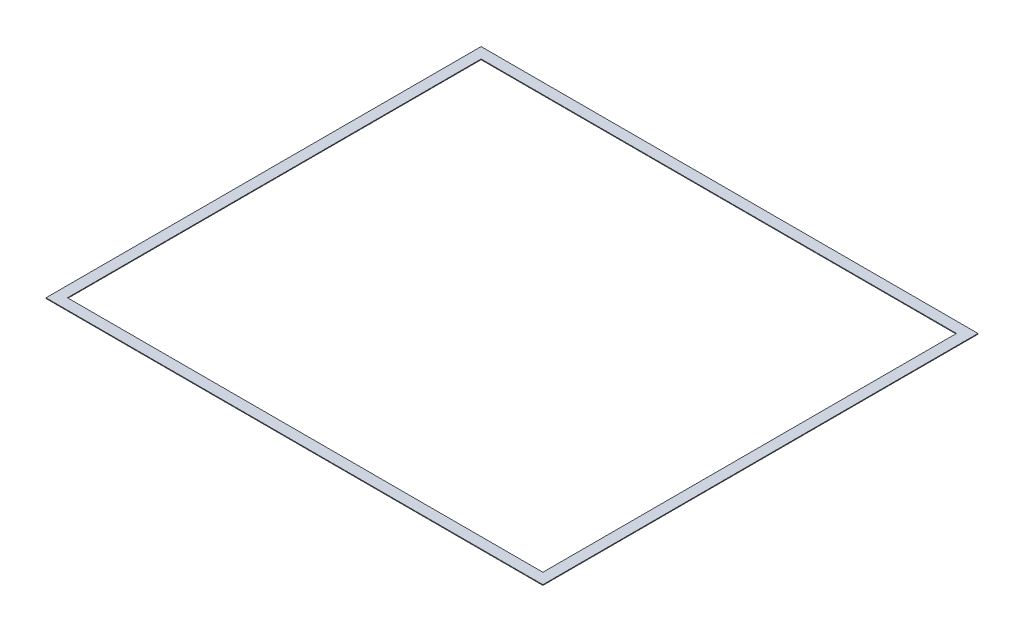
ISO-10303-21;
HEADER;
FILE_DESCRIPTION(('STEP AP214'),'2;1');
FILE_NAME('part.step','',(''),(''),'','','');
FILE_SCHEMA(('AUTOMOTIVE_DESIGN { 1 0 10303 214 1 1 1 1 }'));
ENDSEC;
DATA;
#1=APPLICATION_CONTEXT('core data for automotive mechanical design processes');
#2=APPLICATION_PROTOCOL_DEFINITION('international standard','automotive_design',2000,#1);
#3=PRODUCT_CONTEXT('',#1,'mechanical');
#4=PRODUCT('Part','Part','',(#3));
#5=PRODUCT_RELATED_PRODUCT_CATEGORY('part','',(#4));
#6=PRODUCT_DEFINITION_FORMATION('','',#4);
#7=PRODUCT_DEFINITION_CONTEXT('part definition',#1,'design');
#8=PRODUCT_DEFINITION('design','',#6,#7);
#9=PRODUCT_DEFINITION_SHAPE('','',#8);
#10=(LENGTH_UNIT() NAMED_UNIT(*) SI_UNIT(.MILLI.,.METRE.));
#11=(NAMED_UNIT(*) PLANE_ANGLE_UNIT() SI_UNIT($,.RADIAN.));
#12=(NAMED_UNIT(*) SI_UNIT($,.STERADIAN.) SOLID_ANGLE_UNIT());
#13=UNCERTAINTY_MEASURE_WITH_UNIT(LENGTH_MEASURE(1.E-05),#10,'distance_accuracy_value','');
#14=(GEOMETRIC_REPRESENTATION_CONTEXT(3) GLOBAL_UNCERTAINTY_ASSIGNED_CONTEXT((#13)) GLOBAL_UNIT_ASSIGNED_CONTEXT((#10,
#11,#12)) REPRESENTATION_CONTEXT('',''));
#15=CARTESIAN_POINT('',(0.,0.,0.));
#16=DIRECTION('',(0.,0.,1.));
#17=DIRECTION('',(1.,0.,0.));
#18=AXIS2_PLACEMENT_3D('',#15,#16,#17);
#19=CARTESIAN_POINT('',(0.,3.175,0.));
#20=DIRECTION('',(0.,1.,0.));
#21=DIRECTION('',(0.,0.,1.));
#22=AXIS2_PLACEMENT_3D('',#19,#20,#21);
#23=PLANE('',#22);
#24=DIRECTION('',(0.,0.,-1.));
#25=VECTOR('',#24,1.);
#26=CARTESIAN_POINT('',(1174.75,3.175,-1028.7));
#27=LINE('',#26,#25);
#28=CARTESIAN_POINT('',(1174.75,3.175,1028.7));
#29=VERTEX_POINT('',#28);
#30=CARTESIAN_POINT('',(1174.75,3.175,-1028.7));
#31=VERTEX_POINT('',#30);
#32=EDGE_CURVE('E133',#29,#31,#27,.T.);
#33=ORIENTED_EDGE('',*,*,#32,.T.);
#34=DIRECTION('',(-1.,0.,0.));
#35=VECTOR('',#34,1.);
#36=CARTESIAN_POINT('',(-1174.75,3.175,-1028.7));
#37=LINE('',#36,#35);
#38=CARTESIAN_POINT('',(-1174.75,3.175,-1028.7));
#39=VERTEX_POINT('',#38);
#40=EDGE_CURVE('E136',#31,#39,#37,.T.);
#41=ORIENTED_EDGE('',*,*,#40,.T.);
#42=DIRECTION('',(0.,0.,1.));
#43=VECTOR('',#42,1.);
#44=CARTESIAN_POINT('',(-1174.75,3.175,-1028.7));
#45=LINE('',#44,#43);
#46=CARTESIAN_POINT('',(-1174.75,3.175,1028.7));
#47=VERTEX_POINT('',#46);
#48=EDGE_CURVE('E139',#39,#47,#45,.T.);
#49=ORIENTED_EDGE('',*,*,#48,.T.);
#50=DIRECTION('',(1.,0.,0.));
#51=VECTOR('',#50,1.);
#52=CARTESIAN_POINT('',(-1174.75,3.175,1028.7));
#53=LINE('',#52,#51);
#54=EDGE_CURVE('E141',#47,#29,#53,.T.);
#55=ORIENTED_EDGE('',*,*,#54,.T.);
#56=EDGE_LOOP('',(#33,#41,#49,#55));
#57=FACE_BOUND('',#56,.T.);
#58=DIRECTION('',(-1.,0.,0.));
#59=VECTOR('',#58,1.);
#60=CARTESIAN_POINT('',(-1123.95,3.175,-977.9));
#61=LINE('',#60,#59);
#62=CARTESIAN_POINT('',(1123.95,3.175,-977.9));
#63=VERTEX_POINT('',#62);
#64=CARTESIAN_POINT('',(-1123.95,3.175,-977.9));
#65=VERTEX_POINT('',#64);
#66=EDGE_CURVE('E105',#63,#65,#61,.T.);
#67=ORIENTED_EDGE('',*,*,#66,.F.);
#68=DIRECTION('',(0.,0.,-1.));
#69=VECTOR('',#68,1.);
#70=CARTESIAN_POINT('',(1123.95,3.175,-977.9));
#71=LINE('',#70,#69);
#72=CARTESIAN_POINT('',(1123.95,3.175,977.9));
#73=VERTEX_POINT('',#72);
#74=EDGE_CURVE('E97',#73,#63,#71,.T.);
#75=ORIENTED_EDGE('',*,*,#74,.F.);
#76=DIRECTION('',(1.,0.,0.));
#77=VECTOR('',#76,1.);
#78=CARTESIAN_POINT('',(-1123.95,3.175,977.9));
#79=LINE('',#78,#77);
#80=CARTESIAN_POINT('',(-1123.95,3.175,977.9));
#81=VERTEX_POINT('',#80);
#82=EDGE_CURVE('E119',#81,#73,#79,.T.);
#83=ORIENTED_EDGE('',*,*,#82,.F.);
#84=DIRECTION('',(0.,0.,1.));
#85=VECTOR('',#84,1.);
#86=CARTESIAN_POINT('',(-1123.95,3.175,-977.9));
#87=LINE('',#86,#85);
#88=EDGE_CURVE('E117',#65,#81,#87,.T.);
#89=ORIENTED_EDGE('',*,*,#88,.F.);
#90=EDGE_LOOP('',(#67,#75,#83,#89));
#91=FACE_BOUND('',#90,.T.);
#92=ADVANCED_FACE('F32',(#57,#91),#23,.T.);
#93=CARTESIAN_POINT('',(0.,0.,0.));
#94=DIRECTION('',(0.,1.,0.));
#95=DIRECTION('',(0.,0.,1.));
#96=AXIS2_PLACEMENT_3D('',#93,#94,#95);
#97=PLANE('',#96);
#98=DIRECTION('',(0.,0.,-1.));
#99=VECTOR('',#98,1.);
#100=CARTESIAN_POINT('',(1174.75,0.,-1028.7));
#101=LINE('',#100,#99);
#102=CARTESIAN_POINT('',(1174.75,0.,1028.7));
#103=VERTEX_POINT('',#102);
#104=CARTESIAN_POINT('',(1174.75,0.,-1028.7));
#105=VERTEX_POINT('',#104);
#106=EDGE_CURVE('E113',#103,#105,#101,.T.);
#107=ORIENTED_EDGE('',*,*,#106,.F.);
#108=DIRECTION('',(1.,0.,0.));
#109=VECTOR('',#108,1.);
#110=CARTESIAN_POINT('',(-1174.75,0.,1028.7));
#111=LINE('',#110,#109);
#112=CARTESIAN_POINT('',(-1174.75,0.,1028.7));
#113=VERTEX_POINT('',#112);
#114=EDGE_CURVE('E137',#113,#103,#111,.T.);
#115=ORIENTED_EDGE('',*,*,#114,.F.);
#116=DIRECTION('',(0.,0.,1.));
#117=VECTOR('',#116,1.);
#118=CARTESIAN_POINT('',(-1174.75,0.,-1028.7));
#119=LINE('',#118,#117);
#120=CARTESIAN_POINT('',(-1174.75,0.,-1028.7));
#121=VERTEX_POINT('',#120);
#122=EDGE_CURVE('E148',#121,#113,#119,.T.);
#123=ORIENTED_EDGE('',*,*,#122,.F.);
#124=DIRECTION('',(-1.,0.,0.));
#125=VECTOR('',#124,1.);
#126=CARTESIAN_POINT('',(-1174.75,0.,-1028.7));
#127=LINE('',#126,#125);
#128=EDGE_CURVE('E146',#105,#121,#127,.T.);
#129=ORIENTED_EDGE('',*,*,#128,.F.);
#130=EDGE_LOOP('',(#107,#115,#123,#129));
#131=FACE_BOUND('',#130,.T.);
#132=DIRECTION('',(0.,0.,-1.));
#133=VECTOR('',#132,1.);
#134=CARTESIAN_POINT('',(1123.95,0.,-977.9));
#135=LINE('',#134,#133);
#136=CARTESIAN_POINT('',(1123.95,0.,977.9));
#137=VERTEX_POINT('',#136);
#138=CARTESIAN_POINT('',(1123.95,0.,-977.9));
#139=VERTEX_POINT('',#138);
#140=EDGE_CURVE('E55',#137,#139,#135,.T.);
#141=ORIENTED_EDGE('',*,*,#140,.T.);
#142=DIRECTION('',(-1.,0.,0.));
#143=VECTOR('',#142,1.);
#144=CARTESIAN_POINT('',(-1123.95,0.,-977.9));
#145=LINE('',#144,#143);
#146=CARTESIAN_POINT('',(-1123.95,0.,-977.9));
#147=VERTEX_POINT('',#146);
#148=EDGE_CURVE('E112',#139,#147,#145,.T.);
#149=ORIENTED_EDGE('',*,*,#148,.T.);
#150=DIRECTION('',(0.,0.,1.));
#151=VECTOR('',#150,1.);
#152=CARTESIAN_POINT('',(-1123.95,0.,-977.9));
#153=LINE('',#152,#151);
#154=CARTESIAN_POINT('',(-1123.95,0.,977.9));
#155=VERTEX_POINT('',#154);
#156=EDGE_CURVE('E125',#147,#155,#153,.T.);
#157=ORIENTED_EDGE('',*,*,#156,.T.);
#158=DIRECTION('',(1.,0.,0.));
#159=VECTOR('',#158,1.);
#160=CARTESIAN_POINT('',(-1123.95,0.,977.9));
#161=LINE('',#160,#159);
#162=EDGE_CURVE('E106',#155,#137,#161,.T.);
#163=ORIENTED_EDGE('',*,*,#162,.T.);
#164=EDGE_LOOP('',(#141,#149,#157,#163));
#165=FACE_BOUND('',#164,.T.);
#166=ADVANCED_FACE('F166',(#131,#165),#97,.F.);
#167=CARTESIAN_POINT('',(1174.75,3.175,-1028.7));
#168=DIRECTION('',(-1.,0.,0.));
#169=DIRECTION('',(0.,0.,1.));
#170=AXIS2_PLACEMENT_3D('',#167,#168,#169);
#171=PLANE('',#170);
#172=ORIENTED_EDGE('',*,*,#106,.T.);
#173=DIRECTION('',(0.,-1.,0.));
#174=VECTOR('',#173,1.);
#175=CARTESIAN_POINT('',(1174.75,3.175,-1028.7));
#176=LINE('',#175,#174);
#177=EDGE_CURVE('E11',#31,#105,#176,.T.);
#178=ORIENTED_EDGE('',*,*,#177,.F.);
#179=ORIENTED_EDGE('',*,*,#32,.F.);
#180=DIRECTION('',(0.,-1.,0.));
#181=VECTOR('',#180,1.);
#182=CARTESIAN_POINT('',(1174.75,3.175,1028.7));
#183=LINE('',#182,#181);
#184=EDGE_CURVE('E143',#29,#103,#183,.T.);
#185=ORIENTED_EDGE('',*,*,#184,.T.);
#186=EDGE_LOOP('',(#172,#178,#179,#185));
#187=FACE_BOUND('',#186,.T.);
#188=ADVANCED_FACE('F34',(#187),#171,.F.);
#189=CARTESIAN_POINT('',(-1174.75,3.175,-1028.7));
#190=DIRECTION('',(0.,0.,1.));
#191=DIRECTION('',(1.,0.,0.));
#192=AXIS2_PLACEMENT_3D('',#189,#190,#191);
#193=PLANE('',#192);
#194=ORIENTED_EDGE('',*,*,#128,.T.);
#195=DIRECTION('',(0.,-1.,0.));
#196=VECTOR('',#195,1.);
#197=CARTESIAN_POINT('',(-1174.75,3.175,-1028.7));
#198=LINE('',#197,#196);
#199=EDGE_CURVE('E40',#39,#121,#198,.T.);
#200=ORIENTED_EDGE('',*,*,#199,.F.);
#201=ORIENTED_EDGE('',*,*,#40,.F.);
#202=ORIENTED_EDGE('',*,*,#177,.T.);
#203=EDGE_LOOP('',(#194,#200,#201,#202));
#204=FACE_BOUND('',#203,.T.);
#205=ADVANCED_FACE('F176',(#204),#193,.F.);
#206=CARTESIAN_POINT('',(-1174.75,3.175,-1028.7));
#207=DIRECTION('',(1.,0.,0.));
#208=DIRECTION('',(0.,0.,-1.));
#209=AXIS2_PLACEMENT_3D('',#206,#207,#208);
#210=PLANE('',#209);
#211=ORIENTED_EDGE('',*,*,#122,.T.);
#212=DIRECTION('',(0.,-1.,0.));
#213=VECTOR('',#212,1.);
#214=CARTESIAN_POINT('',(-1174.75,3.175,1028.7));
#215=LINE('',#214,#213);
#216=EDGE_CURVE('E153',#47,#113,#215,.T.);
#217=ORIENTED_EDGE('',*,*,#216,.F.);
#218=ORIENTED_EDGE('',*,*,#48,.F.);
#219=ORIENTED_EDGE('',*,*,#199,.T.);
#220=EDGE_LOOP('',(#211,#217,#218,#219));
#221=FACE_BOUND('',#220,.T.);
#222=ADVANCED_FACE('F160',(#221),#210,.F.);
#223=CARTESIAN_POINT('',(-1174.75,3.175,1028.7));
#224=DIRECTION('',(0.,0.,-1.));
#225=DIRECTION('',(-1.,0.,0.));
#226=AXIS2_PLACEMENT_3D('',#223,#224,#225);
#227=PLANE('',#226);
#228=ORIENTED_EDGE('',*,*,#114,.T.);
#229=ORIENTED_EDGE('',*,*,#184,.F.);
#230=ORIENTED_EDGE('',*,*,#54,.F.);
#231=ORIENTED_EDGE('',*,*,#216,.T.);
#232=EDGE_LOOP('',(#228,#229,#230,#231));
#233=FACE_BOUND('',#232,.T.);
#234=ADVANCED_FACE('F170',(#233),#227,.F.);
#235=CARTESIAN_POINT('',(1123.95,3.175,-977.9));
#236=DIRECTION('',(-1.,0.,0.));
#237=DIRECTION('',(0.,0.,1.));
#238=AXIS2_PLACEMENT_3D('',#235,#236,#237);
#239=PLANE('',#238);
#240=ORIENTED_EDGE('',*,*,#140,.F.);
#241=DIRECTION('',(0.,-1.,0.));
#242=VECTOR('',#241,1.);
#243=CARTESIAN_POINT('',(1123.95,3.175,977.9));
#244=LINE('',#243,#242);
#245=EDGE_CURVE('E101',#73,#137,#244,.T.);
#246=ORIENTED_EDGE('',*,*,#245,.F.);
#247=ORIENTED_EDGE('',*,*,#74,.T.);
#248=DIRECTION('',(0.,-1.,0.));
#249=VECTOR('',#248,1.);
#250=CARTESIAN_POINT('',(1123.95,3.175,-977.9));
#251=LINE('',#250,#249);
#252=EDGE_CURVE('E100',#63,#139,#251,.T.);
#253=ORIENTED_EDGE('',*,*,#252,.T.);
#254=EDGE_LOOP('',(#240,#246,#247,#253));
#255=FACE_BOUND('',#254,.T.);
#256=ADVANCED_FACE('F99',(#255),#239,.T.);
#257=CARTESIAN_POINT('',(-1123.95,3.175,-977.9));
#258=DIRECTION('',(0.,0.,1.));
#259=DIRECTION('',(1.,0.,0.));
#260=AXIS2_PLACEMENT_3D('',#257,#258,#259);
#261=PLANE('',#260);
#262=ORIENTED_EDGE('',*,*,#148,.F.);
#263=ORIENTED_EDGE('',*,*,#252,.F.);
#264=ORIENTED_EDGE('',*,*,#66,.T.);
#265=DIRECTION('',(0.,-1.,0.));
#266=VECTOR('',#265,1.);
#267=CARTESIAN_POINT('',(-1123.95,3.175,-977.9));
#268=LINE('',#267,#266);
#269=EDGE_CURVE('E114',#65,#147,#268,.T.);
#270=ORIENTED_EDGE('',*,*,#269,.T.);
#271=EDGE_LOOP('',(#262,#263,#264,#270));
#272=FACE_BOUND('',#271,.T.);
#273=ADVANCED_FACE('F109',(#272),#261,.T.);
#274=CARTESIAN_POINT('',(-1123.95,3.175,-977.9));
#275=DIRECTION('',(1.,0.,0.));
#276=DIRECTION('',(0.,0.,-1.));
#277=AXIS2_PLACEMENT_3D('',#274,#275,#276);
#278=PLANE('',#277);
#279=ORIENTED_EDGE('',*,*,#156,.F.);
#280=ORIENTED_EDGE('',*,*,#269,.F.);
#281=ORIENTED_EDGE('',*,*,#88,.T.);
#282=DIRECTION('',(0.,-1.,0.));
#283=VECTOR('',#282,1.);
#284=CARTESIAN_POINT('',(-1123.95,3.175,977.9));
#285=LINE('',#284,#283);
#286=EDGE_CURVE('E47',#81,#155,#285,.T.);
#287=ORIENTED_EDGE('',*,*,#286,.T.);
#288=EDGE_LOOP('',(#279,#280,#281,#287));
#289=FACE_BOUND('',#288,.T.);
#290=ADVANCED_FACE('F199',(#289),#278,.T.);
#291=CARTESIAN_POINT('',(-1123.95,3.175,977.9));
#292=DIRECTION('',(0.,0.,-1.));
#293=DIRECTION('',(-1.,0.,0.));
#294=AXIS2_PLACEMENT_3D('',#291,#292,#293);
#295=PLANE('',#294);
#296=ORIENTED_EDGE('',*,*,#162,.F.);
#297=ORIENTED_EDGE('',*,*,#286,.F.);
#298=ORIENTED_EDGE('',*,*,#82,.T.);
#299=ORIENTED_EDGE('',*,*,#245,.T.);
#300=EDGE_LOOP('',(#296,#297,#298,#299));
#301=FACE_BOUND('',#300,.T.);
#302=ADVANCED_FACE('F203',(#301),#295,.T.);
#303=CLOSED_SHELL('',(#92,#166,#188,#205,#222,#234,#256,#273,#290,#302));
#304=MANIFOLD_SOLID_BREP('B2',#303);
#305=ADVANCED_BREP_SHAPE_REPRESENTATION('',(#18,#304),#14);
#306=SHAPE_DEFINITION_REPRESENTATION(#9,#305);
ENDSEC;
END-ISO-10303-21;
